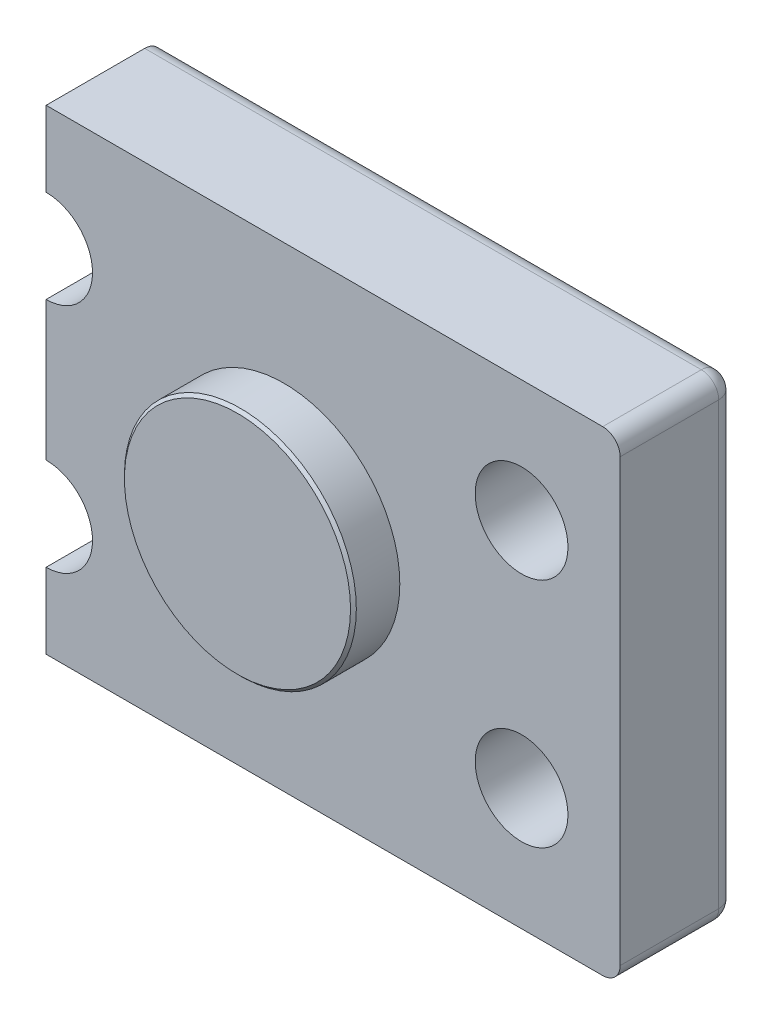
ISO-10303-21;
HEADER;
FILE_DESCRIPTION(('STEP AP214'),'2;1');
FILE_NAME('part.step','',(''),(''),'','','');
FILE_SCHEMA(('AUTOMOTIVE_DESIGN { 1 0 10303 214 1 1 1 1 }'));
ENDSEC;
DATA;
#1=APPLICATION_CONTEXT('core data for automotive mechanical design processes');
#2=APPLICATION_PROTOCOL_DEFINITION('international standard','automotive_design',2000,#1);
#3=PRODUCT_CONTEXT('',#1,'mechanical');
#4=PRODUCT('Part','Part','',(#3));
#5=PRODUCT_RELATED_PRODUCT_CATEGORY('part','',(#4));
#6=PRODUCT_DEFINITION_FORMATION('','',#4);
#7=PRODUCT_DEFINITION_CONTEXT('part definition',#1,'design');
#8=PRODUCT_DEFINITION('design','',#6,#7);
#9=PRODUCT_DEFINITION_SHAPE('','',#8);
#10=(LENGTH_UNIT() NAMED_UNIT(*) SI_UNIT(.MILLI.,.METRE.));
#11=(NAMED_UNIT(*) PLANE_ANGLE_UNIT() SI_UNIT($,.RADIAN.));
#12=(NAMED_UNIT(*) SI_UNIT($,.STERADIAN.) SOLID_ANGLE_UNIT());
#13=UNCERTAINTY_MEASURE_WITH_UNIT(LENGTH_MEASURE(1.E-05),#10,'distance_accuracy_value','');
#14=(GEOMETRIC_REPRESENTATION_CONTEXT(3) GLOBAL_UNCERTAINTY_ASSIGNED_CONTEXT((#13)) GLOBAL_UNIT_ASSIGNED_CONTEXT((#10,
#11,#12)) REPRESENTATION_CONTEXT('',''));
#15=CARTESIAN_POINT('',(0.,0.,0.));
#16=DIRECTION('',(0.,0.,1.));
#17=DIRECTION('',(1.,0.,0.));
#18=AXIS2_PLACEMENT_3D('',#15,#16,#17);
#19=CARTESIAN_POINT('',(0.,0.,20.));
#20=DIRECTION('',(1.,0.,0.));
#21=DIRECTION('',(0.,0.,-1.));
#22=AXIS2_PLACEMENT_3D('',#19,#20,#21);
#23=PLANE('',#22);
#24=DIRECTION('',(0.,-1.,0.));
#25=VECTOR('',#24,1.);
#26=CARTESIAN_POINT('',(0.,0.,0.));
#27=LINE('',#26,#25);
#28=CARTESIAN_POINT('',(0.,13.,0.));
#29=VERTEX_POINT('',#28);
#30=CARTESIAN_POINT('',(0.,3.,0.));
#31=VERTEX_POINT('',#30);
#32=EDGE_CURVE('E253',#29,#31,#27,.T.);
#33=ORIENTED_EDGE('',*,*,#32,.T.);
#34=CARTESIAN_POINT('',(0.,3.,3.));
#35=DIRECTION('',(1.,0.,0.));
#36=DIRECTION('',(0.,0.,-1.));
#37=AXIS2_PLACEMENT_3D('',#34,#35,#36);
#38=CIRCLE('',#37,3.);
#39=CARTESIAN_POINT('',(0.,0.,3.));
#40=VERTEX_POINT('',#39);
#41=EDGE_CURVE('E158',#31,#40,#38,.F.);
#42=ORIENTED_EDGE('',*,*,#41,.T.);
#43=DIRECTION('',(0.,0.,-1.));
#44=VECTOR('',#43,1.);
#45=CARTESIAN_POINT('',(0.,0.,20.));
#46=LINE('',#45,#44);
#47=CARTESIAN_POINT('',(0.,0.,20.));
#48=VERTEX_POINT('',#47);
#49=EDGE_CURVE('E136',#48,#40,#46,.T.);
#50=ORIENTED_EDGE('',*,*,#49,.F.);
#51=DIRECTION('',(0.,-1.,0.));
#52=VECTOR('',#51,1.);
#53=CARTESIAN_POINT('',(0.,0.,20.));
#54=LINE('',#53,#52);
#55=CARTESIAN_POINT('',(0.,13.,20.));
#56=VERTEX_POINT('',#55);
#57=EDGE_CURVE('E144',#56,#48,#54,.T.);
#58=ORIENTED_EDGE('',*,*,#57,.F.);
#59=DIRECTION('',(0.,0.,-1.));
#60=VECTOR('',#59,1.);
#61=CARTESIAN_POINT('',(0.,13.,20.));
#62=LINE('',#61,#60);
#63=EDGE_CURVE('E274',#56,#29,#62,.T.);
#64=ORIENTED_EDGE('',*,*,#63,.T.);
#65=EDGE_LOOP('',(#33,#42,#50,#58,#64));
#66=FACE_BOUND('',#65,.T.);
#67=ADVANCED_FACE('F41',(#66),#23,.F.);
#68=CARTESIAN_POINT('',(0.,0.,20.));
#69=DIRECTION('',(0.,1.,0.));
#70=DIRECTION('',(0.,0.,1.));
#71=AXIS2_PLACEMENT_3D('',#68,#69,#70);
#72=PLANE('',#71);
#73=ORIENTED_EDGE('',*,*,#49,.T.);
#74=DIRECTION('',(1.,0.,0.));
#75=VECTOR('',#74,1.);
#76=CARTESIAN_POINT('',(0.,0.,3.));
#77=LINE('',#76,#75);
#78=CARTESIAN_POINT('',(96.,0.,3.));
#79=VERTEX_POINT('',#78);
#80=EDGE_CURVE('E182',#40,#79,#77,.T.);
#81=ORIENTED_EDGE('',*,*,#80,.T.);
#82=DIRECTION('',(0.,0.,-1.));
#83=VECTOR('',#82,1.);
#84=CARTESIAN_POINT('',(96.,0.,20.));
#85=LINE('',#84,#83);
#86=CARTESIAN_POINT('',(96.,0.,20.));
#87=VERTEX_POINT('',#86);
#88=EDGE_CURVE('E139',#79,#87,#85,.F.);
#89=ORIENTED_EDGE('',*,*,#88,.T.);
#90=DIRECTION('',(1.,0.,0.));
#91=VECTOR('',#90,1.);
#92=CARTESIAN_POINT('',(0.,0.,20.));
#93=LINE('',#92,#91);
#94=EDGE_CURVE('E131',#48,#87,#93,.T.);
#95=ORIENTED_EDGE('',*,*,#94,.F.);
#96=EDGE_LOOP('',(#73,#81,#89,#95));
#97=FACE_BOUND('',#96,.T.);
#98=ADVANCED_FACE('F133',(#97),#72,.F.);
#99=CARTESIAN_POINT('',(99.,0.,20.));
#100=DIRECTION('',(-1.,0.,0.));
#101=DIRECTION('',(0.,0.,1.));
#102=AXIS2_PLACEMENT_3D('',#99,#100,#101);
#103=PLANE('',#102);
#104=DIRECTION('',(0.,1.,0.));
#105=VECTOR('',#104,1.);
#106=CARTESIAN_POINT('',(99.,0.,20.));
#107=LINE('',#106,#105);
#108=CARTESIAN_POINT('',(99.,3.,20.));
#109=VERTEX_POINT('',#108);
#110=CARTESIAN_POINT('',(99.,79.,20.));
#111=VERTEX_POINT('',#110);
#112=EDGE_CURVE('E143',#109,#111,#107,.T.);
#113=ORIENTED_EDGE('',*,*,#112,.F.);
#114=DIRECTION('',(0.,0.,-1.));
#115=VECTOR('',#114,1.);
#116=CARTESIAN_POINT('',(99.,3.,20.));
#117=LINE('',#116,#115);
#118=CARTESIAN_POINT('',(99.,3.,3.));
#119=VERTEX_POINT('',#118);
#120=EDGE_CURVE('E59',#109,#119,#117,.T.);
#121=ORIENTED_EDGE('',*,*,#120,.T.);
#122=DIRECTION('',(0.,1.,0.));
#123=VECTOR('',#122,1.);
#124=CARTESIAN_POINT('',(99.,0.,3.));
#125=LINE('',#124,#123);
#126=CARTESIAN_POINT('',(99.,79.,3.));
#127=VERTEX_POINT('',#126);
#128=EDGE_CURVE('E63',#119,#127,#125,.T.);
#129=ORIENTED_EDGE('',*,*,#128,.T.);
#130=DIRECTION('',(0.,0.,-1.));
#131=VECTOR('',#130,1.);
#132=CARTESIAN_POINT('',(99.,79.,20.));
#133=LINE('',#132,#131);
#134=EDGE_CURVE('E205',#127,#111,#133,.F.);
#135=ORIENTED_EDGE('',*,*,#134,.T.);
#136=EDGE_LOOP('',(#113,#121,#129,#135));
#137=FACE_BOUND('',#136,.T.);
#138=ADVANCED_FACE('F332',(#137),#103,.F.);
#139=CARTESIAN_POINT('',(0.,82.,20.));
#140=DIRECTION('',(0.,-1.,0.));
#141=DIRECTION('',(0.,0.,-1.));
#142=AXIS2_PLACEMENT_3D('',#139,#140,#141);
#143=PLANE('',#142);
#144=DIRECTION('',(0.,0.,-1.));
#145=VECTOR('',#144,1.);
#146=CARTESIAN_POINT('',(96.,82.,20.));
#147=LINE('',#146,#145);
#148=CARTESIAN_POINT('',(96.,82.,20.));
#149=VERTEX_POINT('',#148);
#150=CARTESIAN_POINT('',(96.,82.,3.));
#151=VERTEX_POINT('',#150);
#152=EDGE_CURVE('E196',#149,#151,#147,.T.);
#153=ORIENTED_EDGE('',*,*,#152,.T.);
#154=DIRECTION('',(-1.,0.,0.));
#155=VECTOR('',#154,1.);
#156=CARTESIAN_POINT('',(0.,82.,3.));
#157=LINE('',#156,#155);
#158=CARTESIAN_POINT('',(0.,82.,3.));
#159=VERTEX_POINT('',#158);
#160=EDGE_CURVE('E199',#151,#159,#157,.T.);
#161=ORIENTED_EDGE('',*,*,#160,.T.);
#162=DIRECTION('',(0.,0.,-1.));
#163=VECTOR('',#162,1.);
#164=CARTESIAN_POINT('',(0.,82.,20.));
#165=LINE('',#164,#163);
#166=CARTESIAN_POINT('',(0.,82.,20.));
#167=VERTEX_POINT('',#166);
#168=EDGE_CURVE('E161',#167,#159,#165,.T.);
#169=ORIENTED_EDGE('',*,*,#168,.F.);
#170=DIRECTION('',(-1.,0.,0.));
#171=VECTOR('',#170,1.);
#172=CARTESIAN_POINT('',(0.,82.,20.));
#173=LINE('',#172,#171);
#174=EDGE_CURVE('E260',#149,#167,#173,.T.);
#175=ORIENTED_EDGE('',*,*,#174,.F.);
#176=EDGE_LOOP('',(#153,#161,#169,#175));
#177=FACE_BOUND('',#176,.T.);
#178=ADVANCED_FACE('F338',(#177),#143,.F.);
#179=CARTESIAN_POINT('',(0.,69.,20.));
#180=DIRECTION('',(1.,0.,0.));
#181=DIRECTION('',(0.,0.,-1.));
#182=AXIS2_PLACEMENT_3D('',#179,#180,#181);
#183=PLANE('',#182);
#184=ORIENTED_EDGE('',*,*,#168,.T.);
#185=CARTESIAN_POINT('',(0.,79.,3.));
#186=DIRECTION('',(1.,0.,0.));
#187=DIRECTION('',(0.,0.,-1.));
#188=AXIS2_PLACEMENT_3D('',#185,#186,#187);
#189=CIRCLE('',#188,3.);
#190=CARTESIAN_POINT('',(0.,79.,0.));
#191=VERTEX_POINT('',#190);
#192=EDGE_CURVE('E202',#159,#191,#189,.F.);
#193=ORIENTED_EDGE('',*,*,#192,.T.);
#194=DIRECTION('',(0.,-1.,0.));
#195=VECTOR('',#194,1.);
#196=CARTESIAN_POINT('',(0.,69.,0.));
#197=LINE('',#196,#195);
#198=CARTESIAN_POINT('',(0.,69.,0.));
#199=VERTEX_POINT('',#198);
#200=EDGE_CURVE('E277',#191,#199,#197,.T.);
#201=ORIENTED_EDGE('',*,*,#200,.T.);
#202=DIRECTION('',(0.,0.,-1.));
#203=VECTOR('',#202,1.);
#204=CARTESIAN_POINT('',(0.,69.,20.));
#205=LINE('',#204,#203);
#206=CARTESIAN_POINT('',(0.,69.,20.));
#207=VERTEX_POINT('',#206);
#208=EDGE_CURVE('E169',#207,#199,#205,.T.);
#209=ORIENTED_EDGE('',*,*,#208,.F.);
#210=DIRECTION('',(0.,-1.,0.));
#211=VECTOR('',#210,1.);
#212=CARTESIAN_POINT('',(0.,69.,20.));
#213=LINE('',#212,#211);
#214=EDGE_CURVE('E263',#167,#207,#213,.T.);
#215=ORIENTED_EDGE('',*,*,#214,.F.);
#216=EDGE_LOOP('',(#184,#193,#201,#209,#215));
#217=FACE_BOUND('',#216,.T.);
#218=ADVANCED_FACE('F341',(#217),#183,.F.);
#219=CARTESIAN_POINT('',(0.,61.,20.));
#220=DIRECTION('',(0.,0.,-1.));
#221=DIRECTION('',(-1.,0.,0.));
#222=AXIS2_PLACEMENT_3D('',#219,#220,#221);
#223=CYLINDRICAL_SURFACE('',#222,8.);
#224=CARTESIAN_POINT('',(0.,61.,0.));
#225=DIRECTION('',(0.,0.,-1.));
#226=DIRECTION('',(1.,0.,0.));
#227=AXIS2_PLACEMENT_3D('',#224,#225,#226);
#228=CIRCLE('',#227,8.);
#229=CARTESIAN_POINT('',(0.,53.,0.));
#230=VERTEX_POINT('',#229);
#231=EDGE_CURVE('E280',#199,#230,#228,.T.);
#232=ORIENTED_EDGE('',*,*,#231,.T.);
#233=DIRECTION('',(0.,0.,-1.));
#234=VECTOR('',#233,1.);
#235=CARTESIAN_POINT('',(0.,53.,20.));
#236=LINE('',#235,#234);
#237=CARTESIAN_POINT('',(0.,53.,20.));
#238=VERTEX_POINT('',#237);
#239=EDGE_CURVE('E294',#238,#230,#236,.T.);
#240=ORIENTED_EDGE('',*,*,#239,.F.);
#241=CARTESIAN_POINT('',(0.,61.,20.));
#242=DIRECTION('',(0.,0.,-1.));
#243=DIRECTION('',(1.,0.,0.));
#244=AXIS2_PLACEMENT_3D('',#241,#242,#243);
#245=CIRCLE('',#244,8.);
#246=EDGE_CURVE('E266',#207,#238,#245,.T.);
#247=ORIENTED_EDGE('',*,*,#246,.F.);
#248=ORIENTED_EDGE('',*,*,#208,.T.);
#249=EDGE_LOOP('',(#232,#240,#247,#248));
#250=FACE_BOUND('',#249,.T.);
#251=ADVANCED_FACE('F303',(#250),#223,.F.);
#252=CARTESIAN_POINT('',(0.,29.,20.));
#253=DIRECTION('',(1.,0.,0.));
#254=DIRECTION('',(0.,0.,-1.));
#255=AXIS2_PLACEMENT_3D('',#252,#253,#254);
#256=PLANE('',#255);
#257=DIRECTION('',(0.,-1.,0.));
#258=VECTOR('',#257,1.);
#259=CARTESIAN_POINT('',(0.,29.,0.));
#260=LINE('',#259,#258);
#261=CARTESIAN_POINT('',(0.,29.,0.));
#262=VERTEX_POINT('',#261);
#263=EDGE_CURVE('E283',#230,#262,#260,.T.);
#264=ORIENTED_EDGE('',*,*,#263,.T.);
#265=DIRECTION('',(0.,0.,-1.));
#266=VECTOR('',#265,1.);
#267=CARTESIAN_POINT('',(0.,29.,20.));
#268=LINE('',#267,#266);
#269=CARTESIAN_POINT('',(0.,29.,20.));
#270=VERTEX_POINT('',#269);
#271=EDGE_CURVE('E290',#270,#262,#268,.T.);
#272=ORIENTED_EDGE('',*,*,#271,.F.);
#273=DIRECTION('',(0.,-1.,0.));
#274=VECTOR('',#273,1.);
#275=CARTESIAN_POINT('',(0.,29.,20.));
#276=LINE('',#275,#274);
#277=EDGE_CURVE('E269',#238,#270,#276,.T.);
#278=ORIENTED_EDGE('',*,*,#277,.F.);
#279=ORIENTED_EDGE('',*,*,#239,.T.);
#280=EDGE_LOOP('',(#264,#272,#278,#279));
#281=FACE_BOUND('',#280,.T.);
#282=ADVANCED_FACE('F316',(#281),#256,.F.);
#283=CARTESIAN_POINT('',(0.,21.,20.));
#284=DIRECTION('',(0.,0.,-1.));
#285=DIRECTION('',(-1.,0.,0.));
#286=AXIS2_PLACEMENT_3D('',#283,#284,#285);
#287=CYLINDRICAL_SURFACE('',#286,8.);
#288=CARTESIAN_POINT('',(0.,21.,0.));
#289=DIRECTION('',(0.,0.,-1.));
#290=DIRECTION('',(1.,0.,0.));
#291=AXIS2_PLACEMENT_3D('',#288,#289,#290);
#292=CIRCLE('',#291,8.);
#293=EDGE_CURVE('E154',#262,#29,#292,.T.);
#294=ORIENTED_EDGE('',*,*,#293,.T.);
#295=ORIENTED_EDGE('',*,*,#63,.F.);
#296=CARTESIAN_POINT('',(0.,21.,20.));
#297=DIRECTION('',(0.,0.,-1.));
#298=DIRECTION('',(1.,0.,0.));
#299=AXIS2_PLACEMENT_3D('',#296,#297,#298);
#300=CIRCLE('',#299,8.);
#301=EDGE_CURVE('E149',#270,#56,#300,.T.);
#302=ORIENTED_EDGE('',*,*,#301,.F.);
#303=ORIENTED_EDGE('',*,*,#271,.T.);
#304=EDGE_LOOP('',(#294,#295,#302,#303));
#305=FACE_BOUND('',#304,.T.);
#306=ADVANCED_FACE('F319',(#305),#287,.F.);
#307=CARTESIAN_POINT('',(0.,21.,20.));
#308=DIRECTION('',(0.,0.,1.));
#309=DIRECTION('',(1.,0.,0.));
#310=AXIS2_PLACEMENT_3D('',#307,#308,#309);
#311=PLANE('',#310);
#312=CARTESIAN_POINT('',(41.,41.,20.));
#313=DIRECTION('',(0.,0.,1.));
#314=DIRECTION('',(1.,0.,0.));
#315=AXIS2_PLACEMENT_3D('',#312,#313,#314);
#316=CIRCLE('',#315,20.);
#317=CARTESIAN_POINT('',(61.,41.,20.));
#318=VERTEX_POINT('',#317);
#319=EDGE_CURVE('E160',#318,#318,#316,.T.);
#320=ORIENTED_EDGE('',*,*,#319,.F.);
#321=EDGE_LOOP('',(#320));
#322=FACE_BOUND('',#321,.T.);
#323=CARTESIAN_POINT('',(82.,61.,20.));
#324=DIRECTION('',(0.,0.,1.));
#325=DIRECTION('',(1.,0.,0.));
#326=AXIS2_PLACEMENT_3D('',#323,#324,#325);
#327=CIRCLE('',#326,8.);
#328=CARTESIAN_POINT('',(90.,61.,20.));
#329=VERTEX_POINT('',#328);
#330=EDGE_CURVE('E236',#329,#329,#327,.T.);
#331=ORIENTED_EDGE('',*,*,#330,.F.);
#332=EDGE_LOOP('',(#331));
#333=FACE_BOUND('',#332,.T.);
#334=CARTESIAN_POINT('',(82.,21.,20.));
#335=DIRECTION('',(0.,0.,1.));
#336=DIRECTION('',(1.,0.,0.));
#337=AXIS2_PLACEMENT_3D('',#334,#335,#336);
#338=CIRCLE('',#337,8.);
#339=CARTESIAN_POINT('',(90.,21.,20.));
#340=VERTEX_POINT('',#339);
#341=EDGE_CURVE('E246',#340,#340,#338,.T.);
#342=ORIENTED_EDGE('',*,*,#341,.F.);
#343=EDGE_LOOP('',(#342));
#344=FACE_BOUND('',#343,.T.);
#345=ORIENTED_EDGE('',*,*,#94,.T.);
#346=CARTESIAN_POINT('',(96.,3.,20.));
#347=DIRECTION('',(0.,0.,1.));
#348=DIRECTION('',(1.,0.,0.));
#349=AXIS2_PLACEMENT_3D('',#346,#347,#348);
#350=CIRCLE('',#349,3.);
#351=EDGE_CURVE('E11',#87,#109,#350,.T.);
#352=ORIENTED_EDGE('',*,*,#351,.T.);
#353=ORIENTED_EDGE('',*,*,#112,.T.);
#354=CARTESIAN_POINT('',(96.,79.,20.));
#355=DIRECTION('',(0.,0.,1.));
#356=DIRECTION('',(1.,0.,0.));
#357=AXIS2_PLACEMENT_3D('',#354,#355,#356);
#358=CIRCLE('',#357,3.);
#359=EDGE_CURVE('E51',#111,#149,#358,.T.);
#360=ORIENTED_EDGE('',*,*,#359,.T.);
#361=ORIENTED_EDGE('',*,*,#174,.T.);
#362=ORIENTED_EDGE('',*,*,#214,.T.);
#363=ORIENTED_EDGE('',*,*,#246,.T.);
#364=ORIENTED_EDGE('',*,*,#277,.T.);
#365=ORIENTED_EDGE('',*,*,#301,.T.);
#366=ORIENTED_EDGE('',*,*,#57,.T.);
#367=EDGE_LOOP('',(#345,#352,#353,#360,#361,#362,#363,#364,#365,#366));
#368=FACE_BOUND('',#367,.T.);
#369=ADVANCED_FACE('F147',(#322,#333,#344,#368),#311,.T.);
#370=CARTESIAN_POINT('',(0.,21.,0.));
#371=DIRECTION('',(0.,0.,1.));
#372=DIRECTION('',(1.,0.,0.));
#373=AXIS2_PLACEMENT_3D('',#370,#371,#372);
#374=PLANE('',#373);
#375=CARTESIAN_POINT('',(82.,61.,0.));
#376=DIRECTION('',(0.,0.,1.));
#377=DIRECTION('',(1.,0.,0.));
#378=AXIS2_PLACEMENT_3D('',#375,#376,#377);
#379=CIRCLE('',#378,8.);
#380=CARTESIAN_POINT('',(90.,61.,0.));
#381=VERTEX_POINT('',#380);
#382=EDGE_CURVE('E240',#381,#381,#379,.T.);
#383=ORIENTED_EDGE('',*,*,#382,.T.);
#384=EDGE_LOOP('',(#383));
#385=FACE_BOUND('',#384,.T.);
#386=CARTESIAN_POINT('',(82.,21.,0.));
#387=DIRECTION('',(0.,0.,1.));
#388=DIRECTION('',(1.,0.,0.));
#389=AXIS2_PLACEMENT_3D('',#386,#387,#388);
#390=CIRCLE('',#389,8.);
#391=CARTESIAN_POINT('',(90.,21.,0.));
#392=VERTEX_POINT('',#391);
#393=EDGE_CURVE('E249',#392,#392,#390,.T.);
#394=ORIENTED_EDGE('',*,*,#393,.T.);
#395=EDGE_LOOP('',(#394));
#396=FACE_BOUND('',#395,.T.);
#397=DIRECTION('',(0.,1.,0.));
#398=VECTOR('',#397,1.);
#399=CARTESIAN_POINT('',(96.,21.,0.));
#400=LINE('',#399,#398);
#401=CARTESIAN_POINT('',(96.,79.,0.));
#402=VERTEX_POINT('',#401);
#403=CARTESIAN_POINT('',(96.,3.,0.));
#404=VERTEX_POINT('',#403);
#405=EDGE_CURVE('E185',#402,#404,#400,.F.);
#406=ORIENTED_EDGE('',*,*,#405,.T.);
#407=DIRECTION('',(1.,0.,0.));
#408=VECTOR('',#407,1.);
#409=CARTESIAN_POINT('',(0.,3.,0.));
#410=LINE('',#409,#408);
#411=EDGE_CURVE('E191',#404,#31,#410,.F.);
#412=ORIENTED_EDGE('',*,*,#411,.T.);
#413=ORIENTED_EDGE('',*,*,#32,.F.);
#414=ORIENTED_EDGE('',*,*,#293,.F.);
#415=ORIENTED_EDGE('',*,*,#263,.F.);
#416=ORIENTED_EDGE('',*,*,#231,.F.);
#417=ORIENTED_EDGE('',*,*,#200,.F.);
#418=DIRECTION('',(-1.,0.,0.));
#419=VECTOR('',#418,1.);
#420=CARTESIAN_POINT('',(0.,79.,0.));
#421=LINE('',#420,#419);
#422=EDGE_CURVE('E188',#191,#402,#421,.F.);
#423=ORIENTED_EDGE('',*,*,#422,.T.);
#424=EDGE_LOOP('',(#406,#412,#413,#414,#415,#416,#417,#423));
#425=FACE_BOUND('',#424,.T.);
#426=ADVANCED_FACE('F310',(#385,#396,#425),#374,.F.);
#427=CARTESIAN_POINT('',(82.,21.,0.));
#428=DIRECTION('',(0.,0.,1.));
#429=DIRECTION('',(1.,0.,0.));
#430=AXIS2_PLACEMENT_3D('',#427,#428,#429);
#431=CYLINDRICAL_SURFACE('',#430,8.);
#432=ORIENTED_EDGE('',*,*,#393,.F.);
#433=EDGE_LOOP('',(#432));
#434=FACE_BOUND('',#433,.T.);
#435=ORIENTED_EDGE('',*,*,#341,.T.);
#436=EDGE_LOOP('',(#435));
#437=FACE_BOUND('',#436,.T.);
#438=ADVANCED_FACE('F413',(#434,#437),#431,.F.);
#439=CARTESIAN_POINT('',(82.,61.,0.));
#440=DIRECTION('',(0.,0.,1.));
#441=DIRECTION('',(1.,0.,0.));
#442=AXIS2_PLACEMENT_3D('',#439,#440,#441);
#443=CYLINDRICAL_SURFACE('',#442,8.);
#444=ORIENTED_EDGE('',*,*,#382,.F.);
#445=EDGE_LOOP('',(#444));
#446=FACE_BOUND('',#445,.T.);
#447=ORIENTED_EDGE('',*,*,#330,.T.);
#448=EDGE_LOOP('',(#447));
#449=FACE_BOUND('',#448,.T.);
#450=ADVANCED_FACE('F405',(#446,#449),#443,.F.);
#451=CARTESIAN_POINT('',(41.,41.,28.));
#452=DIRECTION('',(0.,0.,-1.));
#453=DIRECTION('',(-1.,0.,0.));
#454=AXIS2_PLACEMENT_3D('',#451,#452,#453);
#455=CYLINDRICAL_SURFACE('',#454,20.);
#456=CARTESIAN_POINT('',(41.,41.,27.5));
#457=DIRECTION('',(0.,0.,1.));
#458=DIRECTION('',(1.,0.,0.));
#459=AXIS2_PLACEMENT_3D('',#456,#457,#458);
#460=CIRCLE('',#459,20.);
#461=CARTESIAN_POINT('',(61.,41.,27.5));
#462=VERTEX_POINT('',#461);
#463=EDGE_CURVE('E176',#462,#462,#460,.F.);
#464=ORIENTED_EDGE('',*,*,#463,.T.);
#465=EDGE_LOOP('',(#464));
#466=FACE_BOUND('',#465,.T.);
#467=ORIENTED_EDGE('',*,*,#319,.T.);
#468=EDGE_LOOP('',(#467));
#469=FACE_BOUND('',#468,.T.);
#470=ADVANCED_FACE('F397',(#466,#469),#455,.T.);
#471=CARTESIAN_POINT('',(41.,41.,28.));
#472=DIRECTION('',(0.,0.,1.));
#473=DIRECTION('',(1.,0.,0.));
#474=AXIS2_PLACEMENT_3D('',#471,#472,#473);
#475=PLANE('',#474);
#476=CARTESIAN_POINT('',(41.,41.,28.));
#477=DIRECTION('',(0.,0.,1.));
#478=DIRECTION('',(1.,0.,0.));
#479=AXIS2_PLACEMENT_3D('',#476,#477,#478);
#480=CIRCLE('',#479,19.5);
#481=CARTESIAN_POINT('',(60.5,41.,28.));
#482=VERTEX_POINT('',#481);
#483=EDGE_CURVE('E166',#482,#482,#480,.T.);
#484=ORIENTED_EDGE('',*,*,#483,.T.);
#485=EDGE_LOOP('',(#484));
#486=FACE_BOUND('',#485,.T.);
#487=ADVANCED_FACE('F364',(#486),#475,.T.);
#488=CARTESIAN_POINT('',(41.,41.,28.));
#489=DIRECTION('',(0.,0.,-1.));
#490=DIRECTION('',(-1.,0.,0.));
#491=AXIS2_PLACEMENT_3D('',#488,#489,#490);
#492=CONICAL_SURFACE('',#491,19.5,0.785398163397448);
#493=ORIENTED_EDGE('',*,*,#463,.F.);
#494=EDGE_LOOP('',(#493));
#495=FACE_BOUND('',#494,.T.);
#496=ORIENTED_EDGE('',*,*,#483,.F.);
#497=EDGE_LOOP('',(#496));
#498=FACE_BOUND('',#497,.T.);
#499=ADVANCED_FACE('F359',(#495,#498),#492,.T.);
#500=CARTESIAN_POINT('',(96.,79.,20.));
#501=DIRECTION('',(0.,0.,-1.));
#502=DIRECTION('',(-1.,0.,0.));
#503=AXIS2_PLACEMENT_3D('',#500,#501,#502);
#504=CYLINDRICAL_SURFACE('',#503,3.);
#505=ORIENTED_EDGE('',*,*,#359,.F.);
#506=ORIENTED_EDGE('',*,*,#134,.F.);
#507=CARTESIAN_POINT('',(96.,79.,3.));
#508=DIRECTION('',(0.,0.,-1.));
#509=DIRECTION('',(-1.,0.,0.));
#510=AXIS2_PLACEMENT_3D('',#507,#508,#509);
#511=CIRCLE('',#510,3.);
#512=EDGE_CURVE('E45',#151,#127,#511,.T.);
#513=ORIENTED_EDGE('',*,*,#512,.F.);
#514=ORIENTED_EDGE('',*,*,#152,.F.);
#515=EDGE_LOOP('',(#505,#506,#513,#514));
#516=FACE_BOUND('',#515,.T.);
#517=ADVANCED_FACE('F43',(#516),#504,.T.);
#518=CARTESIAN_POINT('',(0.,79.,3.));
#519=DIRECTION('',(-1.,0.,0.));
#520=DIRECTION('',(0.,0.,1.));
#521=AXIS2_PLACEMENT_3D('',#518,#519,#520);
#522=CYLINDRICAL_SURFACE('',#521,3.);
#523=ORIENTED_EDGE('',*,*,#192,.F.);
#524=ORIENTED_EDGE('',*,*,#160,.F.);
#525=CARTESIAN_POINT('',(96.,79.,3.));
#526=DIRECTION('',(1.,0.,0.));
#527=DIRECTION('',(0.,0.,-1.));
#528=AXIS2_PLACEMENT_3D('',#525,#526,#527);
#529=CIRCLE('',#528,3.);
#530=EDGE_CURVE('E228',#402,#151,#529,.T.);
#531=ORIENTED_EDGE('',*,*,#530,.F.);
#532=ORIENTED_EDGE('',*,*,#422,.F.);
#533=EDGE_LOOP('',(#523,#524,#531,#532));
#534=FACE_BOUND('',#533,.T.);
#535=ADVANCED_FACE('F378',(#534),#522,.T.);
#536=CARTESIAN_POINT('',(96.,79.,3.));
#537=DIRECTION('',(0.,0.,1.));
#538=DIRECTION('',(1.,0.,0.));
#539=AXIS2_PLACEMENT_3D('',#536,#537,#538);
#540=SPHERICAL_SURFACE('',#539,3.);
#541=ORIENTED_EDGE('',*,*,#530,.T.);
#542=ORIENTED_EDGE('',*,*,#512,.T.);
#543=CARTESIAN_POINT('',(96.,79.,3.));
#544=DIRECTION('',(0.,1.,0.));
#545=DIRECTION('',(0.,0.,1.));
#546=AXIS2_PLACEMENT_3D('',#543,#544,#545);
#547=CIRCLE('',#546,3.);
#548=EDGE_CURVE('E225',#402,#127,#547,.F.);
#549=ORIENTED_EDGE('',*,*,#548,.F.);
#550=EDGE_LOOP('',(#541,#542,#549));
#551=FACE_BOUND('',#550,.T.);
#552=ADVANCED_FACE('F376',(#551),#540,.T.);
#553=CARTESIAN_POINT('',(96.,3.,20.));
#554=DIRECTION('',(0.,0.,-1.));
#555=DIRECTION('',(-1.,0.,0.));
#556=AXIS2_PLACEMENT_3D('',#553,#554,#555);
#557=CYLINDRICAL_SURFACE('',#556,3.);
#558=ORIENTED_EDGE('',*,*,#351,.F.);
#559=ORIENTED_EDGE('',*,*,#88,.F.);
#560=CARTESIAN_POINT('',(96.,3.,3.));
#561=DIRECTION('',(0.,0.,-1.));
#562=DIRECTION('',(-1.,0.,0.));
#563=AXIS2_PLACEMENT_3D('',#560,#561,#562);
#564=CIRCLE('',#563,3.);
#565=EDGE_CURVE('E221',#119,#79,#564,.T.);
#566=ORIENTED_EDGE('',*,*,#565,.F.);
#567=ORIENTED_EDGE('',*,*,#120,.F.);
#568=EDGE_LOOP('',(#558,#559,#566,#567));
#569=FACE_BOUND('',#568,.T.);
#570=ADVANCED_FACE('F330',(#569),#557,.T.);
#571=CARTESIAN_POINT('',(96.,0.,3.));
#572=DIRECTION('',(0.,1.,0.));
#573=DIRECTION('',(0.,0.,1.));
#574=AXIS2_PLACEMENT_3D('',#571,#572,#573);
#575=CYLINDRICAL_SURFACE('',#574,3.);
#576=ORIENTED_EDGE('',*,*,#548,.T.);
#577=ORIENTED_EDGE('',*,*,#128,.F.);
#578=CARTESIAN_POINT('',(96.,3.,3.));
#579=DIRECTION('',(0.,-1.,0.));
#580=DIRECTION('',(0.,0.,-1.));
#581=AXIS2_PLACEMENT_3D('',#578,#579,#580);
#582=CIRCLE('',#581,3.);
#583=EDGE_CURVE('E217',#404,#119,#582,.T.);
#584=ORIENTED_EDGE('',*,*,#583,.F.);
#585=ORIENTED_EDGE('',*,*,#405,.F.);
#586=EDGE_LOOP('',(#576,#577,#584,#585));
#587=FACE_BOUND('',#586,.T.);
#588=ADVANCED_FACE('F370',(#587),#575,.T.);
#589=CARTESIAN_POINT('',(96.,3.,3.));
#590=DIRECTION('',(0.,0.,1.));
#591=DIRECTION('',(1.,0.,0.));
#592=AXIS2_PLACEMENT_3D('',#589,#590,#591);
#593=SPHERICAL_SURFACE('',#592,3.);
#594=ORIENTED_EDGE('',*,*,#583,.T.);
#595=ORIENTED_EDGE('',*,*,#565,.T.);
#596=CARTESIAN_POINT('',(96.,3.,3.));
#597=DIRECTION('',(1.,0.,0.));
#598=DIRECTION('',(0.,0.,-1.));
#599=AXIS2_PLACEMENT_3D('',#596,#597,#598);
#600=CIRCLE('',#599,3.);
#601=EDGE_CURVE('E214',#404,#79,#600,.F.);
#602=ORIENTED_EDGE('',*,*,#601,.F.);
#603=EDGE_LOOP('',(#594,#595,#602));
#604=FACE_BOUND('',#603,.T.);
#605=ADVANCED_FACE('F327',(#604),#593,.T.);
#606=CARTESIAN_POINT('',(0.,3.,3.));
#607=DIRECTION('',(1.,0.,0.));
#608=DIRECTION('',(0.,0.,-1.));
#609=AXIS2_PLACEMENT_3D('',#606,#607,#608);
#610=CYLINDRICAL_SURFACE('',#609,3.);
#611=ORIENTED_EDGE('',*,*,#41,.F.);
#612=ORIENTED_EDGE('',*,*,#411,.F.);
#613=ORIENTED_EDGE('',*,*,#601,.T.);
#614=ORIENTED_EDGE('',*,*,#80,.F.);
#615=EDGE_LOOP('',(#611,#612,#613,#614));
#616=FACE_BOUND('',#615,.T.);
#617=ADVANCED_FACE('F325',(#616),#610,.T.);
#618=CLOSED_SHELL('',(#67,#98,#138,#178,#218,#251,#282,#306,#369,#426,#438,#450,#470,#487,#499,
#517,#535,#552,#570,#588,#605,#617));
#619=MANIFOLD_SOLID_BREP('B2',#618);
#620=ADVANCED_BREP_SHAPE_REPRESENTATION('',(#18,#619),#14);
#621=SHAPE_DEFINITION_REPRESENTATION(#9,#620);
ENDSEC;
END-ISO-10303-21;
